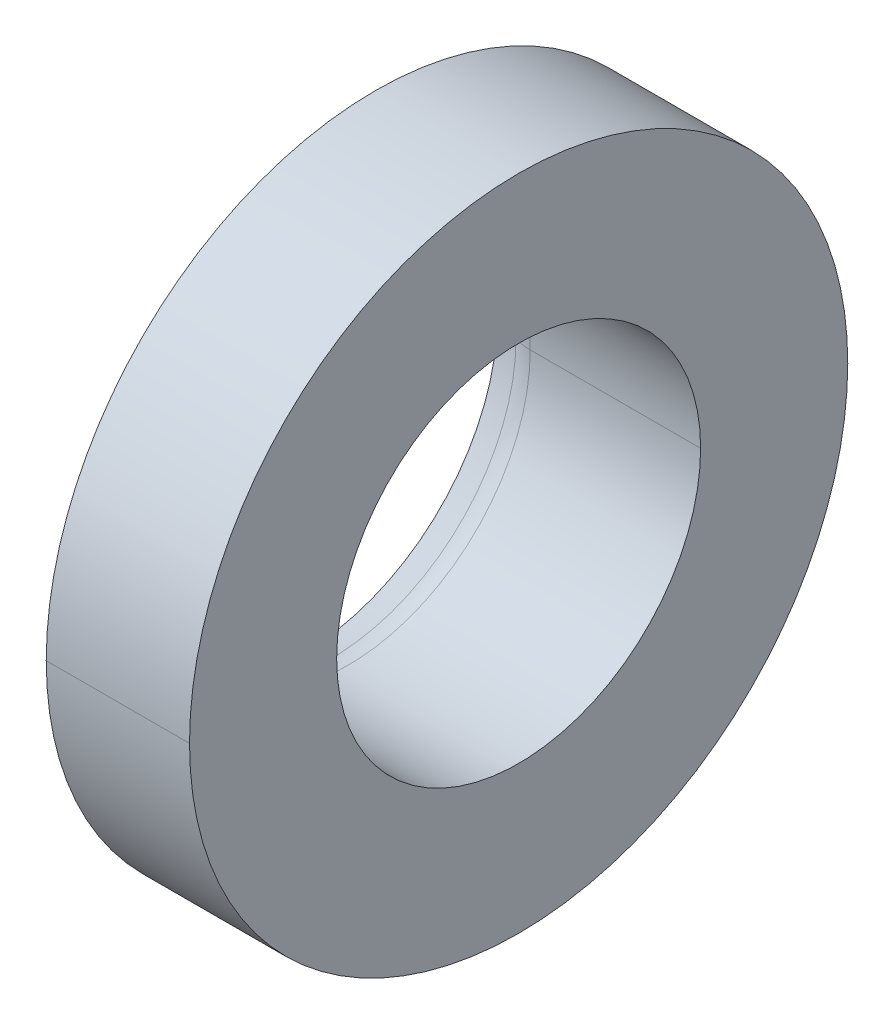
ISO-10303-21;
HEADER;
FILE_DESCRIPTION(('STEP AP214'),'2;1');
FILE_NAME('part.step','',(''),(''),'','','');
FILE_SCHEMA(('AUTOMOTIVE_DESIGN { 1 0 10303 214 1 1 1 1 }'));
ENDSEC;
DATA;
#1=APPLICATION_CONTEXT('core data for automotive mechanical design processes');
#2=APPLICATION_PROTOCOL_DEFINITION('international standard','automotive_design',2000,#1);
#3=PRODUCT_CONTEXT('',#1,'mechanical');
#4=PRODUCT('Part','Part','',(#3));
#5=PRODUCT_RELATED_PRODUCT_CATEGORY('part','',(#4));
#6=PRODUCT_DEFINITION_FORMATION('','',#4);
#7=PRODUCT_DEFINITION_CONTEXT('part definition',#1,'design');
#8=PRODUCT_DEFINITION('design','',#6,#7);
#9=PRODUCT_DEFINITION_SHAPE('','',#8);
#10=(LENGTH_UNIT() NAMED_UNIT(*) SI_UNIT(.MILLI.,.METRE.));
#11=(NAMED_UNIT(*) PLANE_ANGLE_UNIT() SI_UNIT($,.RADIAN.));
#12=(NAMED_UNIT(*) SI_UNIT($,.STERADIAN.) SOLID_ANGLE_UNIT());
#13=UNCERTAINTY_MEASURE_WITH_UNIT(LENGTH_MEASURE(1.E-05),#10,'distance_accuracy_value','');
#14=(GEOMETRIC_REPRESENTATION_CONTEXT(3) GLOBAL_UNCERTAINTY_ASSIGNED_CONTEXT((#13)) GLOBAL_UNIT_ASSIGNED_CONTEXT((#10,
#11,#12)) REPRESENTATION_CONTEXT('',''));
#15=CARTESIAN_POINT('',(0.,0.,0.));
#16=DIRECTION('',(0.,0.,1.));
#17=DIRECTION('',(1.,0.,0.));
#18=AXIS2_PLACEMENT_3D('',#15,#16,#17);
#19=CARTESIAN_POINT('',(-9.97848309128813,0.,0.));
#20=DIRECTION('',(-1.,0.,0.));
#21=DIRECTION('',(0.,0.,1.));
#22=AXIS2_PLACEMENT_3D('',#19,#20,#21);
#23=CONICAL_SURFACE('',#22,2.85490027107471,0.34906585039725);
#24=DIRECTION('',(-0.939692620786461,0.,-0.34202014332415));
#25=VECTOR('',#24,1.);
#26=CARTESIAN_POINT('',(-9.97848309128813,0.,-2.85490027107471));
#27=LINE('',#26,#25);
#28=CARTESIAN_POINT('',(-9.60260604299789,0.,-2.7180922137643));
#29=VERTEX_POINT('',#28);
#30=CARTESIAN_POINT('',(-9.97848309128813,0.,-2.85490027107471));
#31=VERTEX_POINT('',#30);
#32=EDGE_CURVE('E56',#29,#31,#27,.T.);
#33=ORIENTED_EDGE('',*,*,#32,.F.);
#34=CARTESIAN_POINT('',(-9.60260604299789,0.,0.));
#35=DIRECTION('',(-1.,0.,0.));
#36=DIRECTION('',(0.,0.,1.));
#37=AXIS2_PLACEMENT_3D('',#34,#35,#36);
#38=CIRCLE('',#37,2.7180922137643);
#39=CARTESIAN_POINT('',(-9.60260604299789,0.,2.7180922137643));
#40=VERTEX_POINT('',#39);
#41=EDGE_CURVE('E199',#29,#40,#38,.T.);
#42=ORIENTED_EDGE('',*,*,#41,.T.);
#43=DIRECTION('',(-0.939692620786461,0.,0.34202014332415));
#44=VECTOR('',#43,1.);
#45=CARTESIAN_POINT('',(-9.97848309128813,0.,2.85490027107471));
#46=LINE('',#45,#44);
#47=CARTESIAN_POINT('',(-9.97848309128813,0.,2.85490027107471));
#48=VERTEX_POINT('',#47);
#49=EDGE_CURVE('E213',#40,#48,#46,.T.);
#50=ORIENTED_EDGE('',*,*,#49,.T.);
#51=CARTESIAN_POINT('',(-9.97848309128813,0.,0.));
#52=DIRECTION('',(-1.,0.,0.));
#53=DIRECTION('',(0.,0.,1.));
#54=AXIS2_PLACEMENT_3D('',#51,#52,#53);
#55=CIRCLE('',#54,2.85490027107471);
#56=EDGE_CURVE('E11',#31,#48,#55,.T.);
#57=ORIENTED_EDGE('',*,*,#56,.F.);
#58=EDGE_LOOP('',(#33,#42,#50,#57));
#59=FACE_BOUND('',#58,.T.);
#60=ADVANCED_FACE('F17',(#59),#23,.T.);
#61=CARTESIAN_POINT('',(-9.60260604299789,0.,-2.7180922137643));
#62=CARTESIAN_POINT('',(-9.60260604299789,5.43618442752859,-2.7180922137643));
#63=CARTESIAN_POINT('',(-9.60260604299789,5.43618442752859,2.71809221376429));
#64=CARTESIAN_POINT('',(-9.60260604299789,0.,2.7180922137643));
#65=CARTESIAN_POINT('',(-9.56963694430432,0.,-2.70609244318923));
#66=CARTESIAN_POINT('',(-9.56963694430431,5.41218488637845,-2.70609244318923));
#67=CARTESIAN_POINT('',(-9.56963694430431,5.41218488637845,2.70609244318922));
#68=CARTESIAN_POINT('',(-9.56963694430432,0.,2.70609244318923));
#69=CARTESIAN_POINT('',(-9.53508498200828,0.,-2.7));
#70=CARTESIAN_POINT('',(-9.53508498200828,5.4,-2.7));
#71=CARTESIAN_POINT('',(-9.53508498200828,5.4,2.7));
#72=CARTESIAN_POINT('',(-9.53508498200828,0.,2.7));
#73=CARTESIAN_POINT('',(-9.5,0.,-2.7));
#74=CARTESIAN_POINT('',(-9.5,5.4,-2.7));
#75=CARTESIAN_POINT('',(-9.5,5.4,2.7));
#76=CARTESIAN_POINT('',(-9.5,0.,2.7));
#77=(BOUNDED_SURFACE() B_SPLINE_SURFACE(3,3,((#61,#62,#63,#64),(#65,#66,#67,#68),(#69,#70,#71,
#72),(#73,#74,#75,#76)),.UNSPECIFIED.,.F.,.F.,.F.) B_SPLINE_SURFACE_WITH_KNOTS((4,4),(4,4),(0.,
1.),(0.,1.),.UNSPECIFIED.) GEOMETRIC_REPRESENTATION_ITEM() RATIONAL_B_SPLINE_SURFACE(((1.,
0.333333333333334,0.333333333333334,1.),(0.989871835341432,0.329957278447145,0.329957278447145,
0.989871835341432),(0.989871835341432,0.329957278447145,0.329957278447145,0.989871835341432),
(1.,0.333333333333334,0.333333333333334,1.))) REPRESENTATION_ITEM('') SURFACE());
#78=CARTESIAN_POINT('',(-9.5,0.,-3.));
#79=DIRECTION('',(0.,1.,0.));
#80=DIRECTION('',(0.,0.,-1.));
#81=AXIS2_PLACEMENT_3D('',#78,#79,#80);
#82=CIRCLE('',#81,0.3);
#83=CARTESIAN_POINT('',(-9.5,0.,-2.7));
#84=VERTEX_POINT('',#83);
#85=EDGE_CURVE('E194',#29,#84,#82,.T.);
#86=CARTESIAN_POINT('',(-9.60260604299789,0.,0.));
#87=DIRECTION('',(-1.,0.,0.));
#88=DIRECTION('',(0.,0.,1.));
#89=AXIS2_PLACEMENT_3D('',#86,#87,#88);
#90=CIRCLE('',#89,2.7180922137643);
#91=EDGE_CURVE('E205',#40,#29,#90,.T.);
#92=CARTESIAN_POINT('',(-9.5,0.,3.));
#93=DIRECTION('',(0.,-1.,0.));
#94=DIRECTION('',(0.,0.,1.));
#95=AXIS2_PLACEMENT_3D('',#92,#93,#94);
#96=CIRCLE('',#95,0.3);
#97=CARTESIAN_POINT('',(-9.5,0.,2.7));
#98=VERTEX_POINT('',#97);
#99=EDGE_CURVE('E216',#40,#98,#96,.T.);
#100=CARTESIAN_POINT('',(-9.5,0.,0.));
#101=DIRECTION('',(1.,0.,0.));
#102=DIRECTION('',(0.,0.,-1.));
#103=AXIS2_PLACEMENT_3D('',#100,#101,#102);
#104=CIRCLE('',#103,2.7);
#105=EDGE_CURVE('E171',#84,#98,#104,.T.);
#106=ORIENTED_EDGE('',*,*,#85,.F.);
#107=ORIENTED_EDGE('',*,*,#91,.F.);
#108=ORIENTED_EDGE('',*,*,#99,.T.);
#109=ORIENTED_EDGE('',*,*,#105,.F.);
#110=EDGE_LOOP('',(#106,#107,#108,#109));
#111=FACE_BOUND('',#110,.T.);
#112=ADVANCED_FACE('F307',(#111),#77,.F.);
#113=CARTESIAN_POINT('',(-9.97848309137339,0.,0.));
#114=DIRECTION('',(1.,0.,0.));
#115=DIRECTION('',(0.,0.,-1.));
#116=AXIS2_PLACEMENT_3D('',#113,#114,#115);
#117=CONICAL_SURFACE('',#116,2.85490027090418,1.22173047640634);
#118=DIRECTION('',(0.342020143315978,0.,0.939692620789436));
#119=VECTOR('',#118,1.);
#120=CARTESIAN_POINT('',(-9.97848309137339,0.,2.85490027090418));
#121=LINE('',#120,#119);
#122=CARTESIAN_POINT('',(-10.0981901414912,0.,2.52600785381673));
#123=VERTEX_POINT('',#122);
#124=EDGE_CURVE('E183',#123,#48,#121,.T.);
#125=ORIENTED_EDGE('',*,*,#124,.F.);
#126=CARTESIAN_POINT('',(-10.0981901414912,0.,0.));
#127=DIRECTION('',(1.,0.,0.));
#128=DIRECTION('',(0.,0.,-1.));
#129=AXIS2_PLACEMENT_3D('',#126,#127,#128);
#130=CIRCLE('',#129,2.52600785381673);
#131=CARTESIAN_POINT('',(-10.0981901414912,0.,-2.52600785381673));
#132=VERTEX_POINT('',#131);
#133=EDGE_CURVE('E175',#123,#132,#130,.T.);
#134=ORIENTED_EDGE('',*,*,#133,.T.);
#135=DIRECTION('',(0.342020143315978,0.,-0.939692620789436));
#136=VECTOR('',#135,1.);
#137=CARTESIAN_POINT('',(-9.97848309137339,0.,-2.85490027090418));
#138=LINE('',#137,#136);
#139=EDGE_CURVE('E182',#132,#31,#138,.T.);
#140=ORIENTED_EDGE('',*,*,#139,.T.);
#141=ORIENTED_EDGE('',*,*,#56,.T.);
#142=EDGE_LOOP('',(#125,#134,#140,#141));
#143=FACE_BOUND('',#142,.T.);
#144=ADVANCED_FACE('F276',(#143),#117,.T.);
#145=CARTESIAN_POINT('',(-10.23809964855,0.,0.));
#146=DIRECTION('',(1.,0.,0.));
#147=DIRECTION('',(0.,0.,-1.));
#148=AXIS2_PLACEMENT_3D('',#145,#146,#147);
#149=CYLINDRICAL_SURFACE('',#148,2.7);
#150=DIRECTION('',(1.,0.,0.));
#151=VECTOR('',#150,1.);
#152=CARTESIAN_POINT('',(-10.23809964855,0.,2.7));
#153=LINE('',#152,#151);
#154=CARTESIAN_POINT('',(-9.15,0.,2.7));
#155=VERTEX_POINT('',#154);
#156=EDGE_CURVE('E167',#98,#155,#153,.T.);
#157=ORIENTED_EDGE('',*,*,#156,.F.);
#158=CARTESIAN_POINT('',(-9.5,0.,0.));
#159=DIRECTION('',(1.,0.,0.));
#160=DIRECTION('',(0.,0.,-1.));
#161=AXIS2_PLACEMENT_3D('',#158,#159,#160);
#162=CIRCLE('',#161,2.7);
#163=EDGE_CURVE('E198',#98,#84,#162,.T.);
#164=ORIENTED_EDGE('',*,*,#163,.T.);
#165=DIRECTION('',(1.,0.,0.));
#166=VECTOR('',#165,1.);
#167=CARTESIAN_POINT('',(-10.23809964855,0.,-2.7));
#168=LINE('',#167,#166);
#169=CARTESIAN_POINT('',(-9.15,0.,-2.7));
#170=VERTEX_POINT('',#169);
#171=EDGE_CURVE('E234',#84,#170,#168,.T.);
#172=ORIENTED_EDGE('',*,*,#171,.T.);
#173=CARTESIAN_POINT('',(-9.15,0.,0.));
#174=DIRECTION('',(-1.,0.,0.));
#175=DIRECTION('',(0.,0.,-1.));
#176=AXIS2_PLACEMENT_3D('',#173,#174,#175);
#177=CIRCLE('',#176,2.7);
#178=EDGE_CURVE('E28',#170,#155,#177,.T.);
#179=ORIENTED_EDGE('',*,*,#178,.T.);
#180=EDGE_LOOP('',(#157,#164,#172,#179));
#181=FACE_BOUND('',#180,.T.);
#182=ADVANCED_FACE('F329',(#181),#149,.T.);
#183=CARTESIAN_POINT('',(-10.0981901414912,0.,0.));
#184=DIRECTION('',(-1.,0.,0.));
#185=DIRECTION('',(0.,0.,1.));
#186=AXIS2_PLACEMENT_3D('',#183,#184,#185);
#187=CONICAL_SURFACE('',#186,2.52600785381673,0.349065850366811);
#188=DIRECTION('',(-0.939692620796872,0.,-0.342020143295547));
#189=VECTOR('',#188,1.);
#190=CARTESIAN_POINT('',(-10.0981901414912,0.,-2.52600785381673));
#191=LINE('',#190,#189);
#192=CARTESIAN_POINT('',(-9.72231309316191,0.,-2.38919979648924));
#193=VERTEX_POINT('',#192);
#194=EDGE_CURVE('E172',#193,#132,#191,.T.);
#195=ORIENTED_EDGE('',*,*,#194,.F.);
#196=CARTESIAN_POINT('',(-9.72231309316191,0.,0.));
#197=DIRECTION('',(-1.,0.,0.));
#198=DIRECTION('',(0.,0.,1.));
#199=AXIS2_PLACEMENT_3D('',#196,#197,#198);
#200=CIRCLE('',#199,2.38919979648924);
#201=CARTESIAN_POINT('',(-9.72231309316191,0.,2.38919979648924));
#202=VERTEX_POINT('',#201);
#203=EDGE_CURVE('E165',#202,#193,#200,.T.);
#204=ORIENTED_EDGE('',*,*,#203,.F.);
#205=DIRECTION('',(-0.939692620796872,0.,0.342020143295547));
#206=VECTOR('',#205,1.);
#207=CARTESIAN_POINT('',(-10.0981901414912,0.,2.52600785381673));
#208=LINE('',#207,#206);
#209=EDGE_CURVE('E227',#202,#123,#208,.T.);
#210=ORIENTED_EDGE('',*,*,#209,.T.);
#211=CARTESIAN_POINT('',(-10.0981901414912,0.,0.));
#212=DIRECTION('',(1.,0.,0.));
#213=DIRECTION('',(0.,0.,-1.));
#214=AXIS2_PLACEMENT_3D('',#211,#212,#213);
#215=CIRCLE('',#214,2.52600785381673);
#216=EDGE_CURVE('E187',#132,#123,#215,.T.);
#217=ORIENTED_EDGE('',*,*,#216,.F.);
#218=EDGE_LOOP('',(#195,#204,#210,#217));
#219=FACE_BOUND('',#218,.T.);
#220=ADVANCED_FACE('F270',(#219),#187,.F.);
#221=CARTESIAN_POINT('',(-9.15,0.,0.));
#222=DIRECTION('',(1.,0.,0.));
#223=DIRECTION('',(0.,1.,0.));
#224=AXIS2_PLACEMENT_3D('',#221,#222,#223);
#225=PLANE('',#224);
#226=ORIENTED_EDGE('',*,*,#178,.F.);
#227=CARTESIAN_POINT('',(-9.15,0.,0.));
#228=DIRECTION('',(-1.,0.,0.));
#229=DIRECTION('',(0.,0.,-1.));
#230=AXIS2_PLACEMENT_3D('',#227,#228,#229);
#231=CIRCLE('',#230,2.7);
#232=EDGE_CURVE('E170',#155,#170,#231,.T.);
#233=ORIENTED_EDGE('',*,*,#232,.F.);
#234=EDGE_LOOP('',(#226,#233));
#235=FACE_BOUND('',#234,.T.);
#236=CARTESIAN_POINT('',(-9.15,0.,0.));
#237=DIRECTION('',(1.,0.,0.));
#238=DIRECTION('',(0.,0.,-1.));
#239=AXIS2_PLACEMENT_3D('',#236,#237,#238);
#240=CIRCLE('',#239,4.25);
#241=CARTESIAN_POINT('',(-9.15,0.,-4.25));
#242=VERTEX_POINT('',#241);
#243=CARTESIAN_POINT('',(-9.15,0.,4.25));
#244=VERTEX_POINT('',#243);
#245=EDGE_CURVE('E151',#242,#244,#240,.T.);
#246=ORIENTED_EDGE('',*,*,#245,.F.);
#247=CARTESIAN_POINT('',(-9.15,0.,0.));
#248=DIRECTION('',(1.,0.,0.));
#249=DIRECTION('',(0.,0.,-1.));
#250=AXIS2_PLACEMENT_3D('',#247,#248,#249);
#251=CIRCLE('',#250,4.25);
#252=EDGE_CURVE('E128',#244,#242,#251,.T.);
#253=ORIENTED_EDGE('',*,*,#252,.F.);
#254=EDGE_LOOP('',(#246,#253));
#255=FACE_BOUND('',#254,.T.);
#256=ADVANCED_FACE('F336',(#235,#255),#225,.F.);
#257=CARTESIAN_POINT('',(-9.72231309316191,0.,2.38919979648924));
#258=CARTESIAN_POINT('',(-9.7223130931619,-4.77839959297848,2.38919979648924));
#259=CARTESIAN_POINT('',(-9.7223130931619,-4.77839959297848,-2.38919979648924));
#260=CARTESIAN_POINT('',(-9.72231309316191,0.,-2.38919979648924));
#261=CARTESIAN_POINT('',(-9.65088004599256,0.,2.36320029357663));
#262=CARTESIAN_POINT('',(-9.65088004599254,-4.72640058715326,2.36320029357663));
#263=CARTESIAN_POINT('',(-9.65088004599254,-4.72640058715326,-2.36320029357663));
#264=CARTESIAN_POINT('',(-9.65088004599256,0.,-2.36320029357663));
#265=CARTESIAN_POINT('',(-9.57601746101787,0.,2.35));
#266=CARTESIAN_POINT('',(-9.57601746101786,-4.69999999999999,2.35));
#267=CARTESIAN_POINT('',(-9.57601746101786,-4.69999999999999,-2.35));
#268=CARTESIAN_POINT('',(-9.57601746101787,0.,-2.35));
#269=CARTESIAN_POINT('',(-9.5,0.,2.35));
#270=CARTESIAN_POINT('',(-9.5,-4.69999999999999,2.35));
#271=CARTESIAN_POINT('',(-9.5,-4.69999999999999,-2.35));
#272=CARTESIAN_POINT('',(-9.5,0.,-2.35));
#273=(BOUNDED_SURFACE() B_SPLINE_SURFACE(3,3,((#257,#258,#259,#260),(#261,#262,#263,#264),(#265,
#266,#267,#268),(#269,#270,#271,#272)),.UNSPECIFIED.,.F.,.F.,
.F.) B_SPLINE_SURFACE_WITH_KNOTS((4,4),(4,4),(0.,1.),(0.,1.),
.UNSPECIFIED.) GEOMETRIC_REPRESENTATION_ITEM() RATIONAL_B_SPLINE_SURFACE(((1.,0.333333333333334,
0.333333333333334,1.),(0.98987183534145,0.329957278447151,0.329957278447151,0.98987183534145),
(0.98987183534145,0.329957278447151,0.329957278447151,0.98987183534145),(1.,0.333333333333334,
0.333333333333334,1.))) REPRESENTATION_ITEM('') SURFACE());
#274=CARTESIAN_POINT('',(-9.5,0.,-3.));
#275=DIRECTION('',(0.,1.,0.));
#276=DIRECTION('',(0.,0.,-1.));
#277=AXIS2_PLACEMENT_3D('',#274,#275,#276);
#278=CIRCLE('',#277,0.65);
#279=CARTESIAN_POINT('',(-9.5,0.,-2.35));
#280=VERTEX_POINT('',#279);
#281=EDGE_CURVE('E208',#193,#280,#278,.T.);
#282=CARTESIAN_POINT('',(-9.72231309316191,0.,0.));
#283=DIRECTION('',(-1.,0.,0.));
#284=DIRECTION('',(0.,0.,1.));
#285=AXIS2_PLACEMENT_3D('',#282,#283,#284);
#286=CIRCLE('',#285,2.38919979648924);
#287=EDGE_CURVE('E176',#193,#202,#286,.T.);
#288=CARTESIAN_POINT('',(-9.5,0.,3.));
#289=DIRECTION('',(0.,-1.,0.));
#290=DIRECTION('',(0.,0.,1.));
#291=AXIS2_PLACEMENT_3D('',#288,#289,#290);
#292=CIRCLE('',#291,0.65);
#293=CARTESIAN_POINT('',(-9.5,0.,2.35));
#294=VERTEX_POINT('',#293);
#295=EDGE_CURVE('E286',#202,#294,#292,.T.);
#296=CARTESIAN_POINT('',(-9.5,0.,0.));
#297=DIRECTION('',(1.,0.,0.));
#298=DIRECTION('',(0.,0.,-1.));
#299=AXIS2_PLACEMENT_3D('',#296,#297,#298);
#300=CIRCLE('',#299,2.35);
#301=EDGE_CURVE('E161',#294,#280,#300,.T.);
#302=ORIENTED_EDGE('',*,*,#281,.F.);
#303=ORIENTED_EDGE('',*,*,#287,.T.);
#304=ORIENTED_EDGE('',*,*,#295,.T.);
#305=ORIENTED_EDGE('',*,*,#301,.T.);
#306=EDGE_LOOP('',(#302,#303,#304,#305));
#307=FACE_BOUND('',#306,.T.);
#308=ADVANCED_FACE('F330',(#307),#273,.T.);
#309=CARTESIAN_POINT('',(-10.23809964855,0.,0.));
#310=DIRECTION('',(1.,0.,0.));
#311=DIRECTION('',(0.,0.,-1.));
#312=AXIS2_PLACEMENT_3D('',#309,#310,#311);
#313=CYLINDRICAL_SURFACE('',#312,4.25);
#314=DIRECTION('',(1.,0.,0.));
#315=VECTOR('',#314,1.);
#316=CARTESIAN_POINT('',(-10.23809964855,0.,4.25));
#317=LINE('',#316,#315);
#318=CARTESIAN_POINT('',(-7.3,0.,4.25));
#319=VERTEX_POINT('',#318);
#320=EDGE_CURVE('E193',#244,#319,#317,.T.);
#321=ORIENTED_EDGE('',*,*,#320,.F.);
#322=ORIENTED_EDGE('',*,*,#252,.T.);
#323=DIRECTION('',(1.,0.,0.));
#324=VECTOR('',#323,1.);
#325=CARTESIAN_POINT('',(-10.23809964855,0.,-4.25));
#326=LINE('',#325,#324);
#327=CARTESIAN_POINT('',(-7.3,0.,-4.25));
#328=VERTEX_POINT('',#327);
#329=EDGE_CURVE('E192',#242,#328,#326,.T.);
#330=ORIENTED_EDGE('',*,*,#329,.T.);
#331=CARTESIAN_POINT('',(-7.3,0.,0.));
#332=DIRECTION('',(1.,0.,0.));
#333=DIRECTION('',(0.,0.,-1.));
#334=AXIS2_PLACEMENT_3D('',#331,#332,#333);
#335=CIRCLE('',#334,4.25);
#336=EDGE_CURVE('E142',#319,#328,#335,.T.);
#337=ORIENTED_EDGE('',*,*,#336,.F.);
#338=EDGE_LOOP('',(#321,#322,#330,#337));
#339=FACE_BOUND('',#338,.T.);
#340=ADVANCED_FACE('F335',(#339),#313,.T.);
#341=CARTESIAN_POINT('',(-10.23809964855,0.,0.));
#342=DIRECTION('',(1.,0.,0.));
#343=DIRECTION('',(0.,0.,-1.));
#344=AXIS2_PLACEMENT_3D('',#341,#342,#343);
#345=CYLINDRICAL_SURFACE('',#344,2.35);
#346=DIRECTION('',(1.,0.,0.));
#347=VECTOR('',#346,1.);
#348=CARTESIAN_POINT('',(-10.23809964855,0.,2.35));
#349=LINE('',#348,#347);
#350=CARTESIAN_POINT('',(-7.3,0.,2.35));
#351=VERTEX_POINT('',#350);
#352=EDGE_CURVE('E71',#294,#351,#349,.T.);
#353=ORIENTED_EDGE('',*,*,#352,.F.);
#354=CARTESIAN_POINT('',(-9.5,0.,0.));
#355=DIRECTION('',(1.,0.,0.));
#356=DIRECTION('',(0.,0.,-1.));
#357=AXIS2_PLACEMENT_3D('',#354,#355,#356);
#358=CIRCLE('',#357,2.35);
#359=EDGE_CURVE('E146',#280,#294,#358,.T.);
#360=ORIENTED_EDGE('',*,*,#359,.F.);
#361=DIRECTION('',(1.,0.,0.));
#362=VECTOR('',#361,1.);
#363=CARTESIAN_POINT('',(-10.23809964855,0.,-2.35));
#364=LINE('',#363,#362);
#365=CARTESIAN_POINT('',(-7.3,0.,-2.35));
#366=VERTEX_POINT('',#365);
#367=EDGE_CURVE('E143',#280,#366,#364,.T.);
#368=ORIENTED_EDGE('',*,*,#367,.T.);
#369=CARTESIAN_POINT('',(-7.3,0.,0.));
#370=DIRECTION('',(-1.,0.,0.));
#371=DIRECTION('',(0.,0.,-1.));
#372=AXIS2_PLACEMENT_3D('',#369,#370,#371);
#373=CIRCLE('',#372,2.35);
#374=EDGE_CURVE('E21',#351,#366,#373,.T.);
#375=ORIENTED_EDGE('',*,*,#374,.F.);
#376=EDGE_LOOP('',(#353,#360,#368,#375));
#377=FACE_BOUND('',#376,.T.);
#378=ADVANCED_FACE('F144',(#377),#345,.F.);
#379=CARTESIAN_POINT('',(-7.3,0.,0.));
#380=DIRECTION('',(1.,0.,0.));
#381=DIRECTION('',(0.,1.,0.));
#382=AXIS2_PLACEMENT_3D('',#379,#380,#381);
#383=PLANE('',#382);
#384=CARTESIAN_POINT('',(-7.3,0.,0.));
#385=DIRECTION('',(-1.,0.,0.));
#386=DIRECTION('',(0.,0.,-1.));
#387=AXIS2_PLACEMENT_3D('',#384,#385,#386);
#388=CIRCLE('',#387,2.35);
#389=EDGE_CURVE('E140',#366,#351,#388,.T.);
#390=ORIENTED_EDGE('',*,*,#389,.T.);
#391=ORIENTED_EDGE('',*,*,#374,.T.);
#392=EDGE_LOOP('',(#390,#391));
#393=FACE_BOUND('',#392,.T.);
#394=CARTESIAN_POINT('',(-7.3,0.,0.));
#395=DIRECTION('',(1.,0.,0.));
#396=DIRECTION('',(0.,0.,-1.));
#397=AXIS2_PLACEMENT_3D('',#394,#395,#396);
#398=CIRCLE('',#397,4.25);
#399=EDGE_CURVE('E188',#328,#319,#398,.T.);
#400=ORIENTED_EDGE('',*,*,#399,.T.);
#401=ORIENTED_EDGE('',*,*,#336,.T.);
#402=EDGE_LOOP('',(#400,#401));
#403=FACE_BOUND('',#402,.T.);
#404=ADVANCED_FACE('F137',(#393,#403),#383,.T.);
#405=CARTESIAN_POINT('',(-9.97848309128813,0.,0.));
#406=DIRECTION('',(-1.,0.,0.));
#407=DIRECTION('',(0.,0.,1.));
#408=AXIS2_PLACEMENT_3D('',#405,#406,#407);
#409=CONICAL_SURFACE('',#408,2.85490027107471,0.34906585039725);
#410=ORIENTED_EDGE('',*,*,#91,.T.);
#411=ORIENTED_EDGE('',*,*,#32,.T.);
#412=CARTESIAN_POINT('',(-9.97848309128813,0.,0.));
#413=DIRECTION('',(-1.,0.,0.));
#414=DIRECTION('',(0.,0.,1.));
#415=AXIS2_PLACEMENT_3D('',#412,#413,#414);
#416=CIRCLE('',#415,2.85490027107471);
#417=EDGE_CURVE('E178',#48,#31,#416,.T.);
#418=ORIENTED_EDGE('',*,*,#417,.F.);
#419=ORIENTED_EDGE('',*,*,#49,.F.);
#420=EDGE_LOOP('',(#410,#411,#418,#419));
#421=FACE_BOUND('',#420,.T.);
#422=ADVANCED_FACE('F309',(#421),#409,.T.);
#423=CARTESIAN_POINT('',(-9.97848309137339,0.,0.));
#424=DIRECTION('',(1.,0.,0.));
#425=DIRECTION('',(0.,0.,-1.));
#426=AXIS2_PLACEMENT_3D('',#423,#424,#425);
#427=CONICAL_SURFACE('',#426,2.85490027090418,1.22173047640634);
#428=ORIENTED_EDGE('',*,*,#216,.T.);
#429=ORIENTED_EDGE('',*,*,#124,.T.);
#430=ORIENTED_EDGE('',*,*,#417,.T.);
#431=ORIENTED_EDGE('',*,*,#139,.F.);
#432=EDGE_LOOP('',(#428,#429,#430,#431));
#433=FACE_BOUND('',#432,.T.);
#434=ADVANCED_FACE('F278',(#433),#427,.T.);
#435=CARTESIAN_POINT('',(-10.23809964855,0.,0.));
#436=DIRECTION('',(1.,0.,0.));
#437=DIRECTION('',(0.,0.,-1.));
#438=AXIS2_PLACEMENT_3D('',#435,#436,#437);
#439=CYLINDRICAL_SURFACE('',#438,2.7);
#440=ORIENTED_EDGE('',*,*,#105,.T.);
#441=ORIENTED_EDGE('',*,*,#156,.T.);
#442=ORIENTED_EDGE('',*,*,#232,.T.);
#443=ORIENTED_EDGE('',*,*,#171,.F.);
#444=EDGE_LOOP('',(#440,#441,#442,#443));
#445=FACE_BOUND('',#444,.T.);
#446=ADVANCED_FACE('F317',(#445),#439,.T.);
#447=CARTESIAN_POINT('',(-10.0981901414912,0.,0.));
#448=DIRECTION('',(-1.,0.,0.));
#449=DIRECTION('',(0.,0.,1.));
#450=AXIS2_PLACEMENT_3D('',#447,#448,#449);
#451=CONICAL_SURFACE('',#450,2.52600785381673,0.349065850366811);
#452=ORIENTED_EDGE('',*,*,#287,.F.);
#453=ORIENTED_EDGE('',*,*,#194,.T.);
#454=ORIENTED_EDGE('',*,*,#133,.F.);
#455=ORIENTED_EDGE('',*,*,#209,.F.);
#456=EDGE_LOOP('',(#452,#453,#454,#455));
#457=FACE_BOUND('',#456,.T.);
#458=ADVANCED_FACE('F19',(#457),#451,.F.);
#459=CARTESIAN_POINT('',(-10.23809964855,0.,0.));
#460=DIRECTION('',(1.,0.,0.));
#461=DIRECTION('',(0.,0.,-1.));
#462=AXIS2_PLACEMENT_3D('',#459,#460,#461);
#463=CYLINDRICAL_SURFACE('',#462,4.25);
#464=ORIENTED_EDGE('',*,*,#245,.T.);
#465=ORIENTED_EDGE('',*,*,#320,.T.);
#466=ORIENTED_EDGE('',*,*,#399,.F.);
#467=ORIENTED_EDGE('',*,*,#329,.F.);
#468=EDGE_LOOP('',(#464,#465,#466,#467));
#469=FACE_BOUND('',#468,.T.);
#470=ADVANCED_FACE('F345',(#469),#463,.T.);
#471=CARTESIAN_POINT('',(-10.23809964855,0.,0.));
#472=DIRECTION('',(1.,0.,0.));
#473=DIRECTION('',(0.,0.,-1.));
#474=AXIS2_PLACEMENT_3D('',#471,#472,#473);
#475=CYLINDRICAL_SURFACE('',#474,2.35);
#476=ORIENTED_EDGE('',*,*,#301,.F.);
#477=ORIENTED_EDGE('',*,*,#352,.T.);
#478=ORIENTED_EDGE('',*,*,#389,.F.);
#479=ORIENTED_EDGE('',*,*,#367,.F.);
#480=EDGE_LOOP('',(#476,#477,#478,#479));
#481=FACE_BOUND('',#480,.T.);
#482=ADVANCED_FACE('F153',(#481),#475,.F.);
#483=CARTESIAN_POINT('',(-9.60260604299789,0.,2.7180922137643));
#484=CARTESIAN_POINT('',(-9.60260604299789,-5.43618442752859,2.7180922137643));
#485=CARTESIAN_POINT('',(-9.60260604299789,-5.43618442752859,-2.71809221376429));
#486=CARTESIAN_POINT('',(-9.60260604299789,0.,-2.7180922137643));
#487=CARTESIAN_POINT('',(-9.56963694430432,0.,2.70609244318923));
#488=CARTESIAN_POINT('',(-9.56963694430431,-5.41218488637845,2.70609244318923));
#489=CARTESIAN_POINT('',(-9.56963694430431,-5.41218488637845,-2.70609244318922));
#490=CARTESIAN_POINT('',(-9.56963694430432,0.,-2.70609244318923));
#491=CARTESIAN_POINT('',(-9.53508498200828,0.,2.7));
#492=CARTESIAN_POINT('',(-9.53508498200828,-5.4,2.7));
#493=CARTESIAN_POINT('',(-9.53508498200828,-5.4,-2.7));
#494=CARTESIAN_POINT('',(-9.53508498200828,0.,-2.7));
#495=CARTESIAN_POINT('',(-9.5,0.,2.7));
#496=CARTESIAN_POINT('',(-9.5,-5.4,2.7));
#497=CARTESIAN_POINT('',(-9.5,-5.4,-2.7));
#498=CARTESIAN_POINT('',(-9.5,0.,-2.7));
#499=(BOUNDED_SURFACE() B_SPLINE_SURFACE(3,3,((#483,#484,#485,#486),(#487,#488,#489,#490),(#491,
#492,#493,#494),(#495,#496,#497,#498)),.UNSPECIFIED.,.F.,.F.,
.F.) B_SPLINE_SURFACE_WITH_KNOTS((4,4),(4,4),(0.,1.),(0.,1.),
.UNSPECIFIED.) GEOMETRIC_REPRESENTATION_ITEM() RATIONAL_B_SPLINE_SURFACE(((1.,0.333333333333334,
0.333333333333334,1.),(0.989871835341432,0.329957278447145,0.329957278447145,0.989871835341432),
(0.989871835341432,0.329957278447145,0.329957278447145,0.989871835341432),(1.,0.333333333333334,
0.333333333333334,1.))) REPRESENTATION_ITEM('') SURFACE());
#500=ORIENTED_EDGE('',*,*,#41,.F.);
#501=ORIENTED_EDGE('',*,*,#85,.T.);
#502=ORIENTED_EDGE('',*,*,#163,.F.);
#503=ORIENTED_EDGE('',*,*,#99,.F.);
#504=EDGE_LOOP('',(#500,#501,#502,#503));
#505=FACE_BOUND('',#504,.T.);
#506=ADVANCED_FACE('F301',(#505),#499,.F.);
#507=CARTESIAN_POINT('',(-9.72231309316191,0.,-2.38919979648924));
#508=CARTESIAN_POINT('',(-9.7223130931619,4.77839959297848,-2.38919979648924));
#509=CARTESIAN_POINT('',(-9.7223130931619,4.77839959297848,2.38919979648924));
#510=CARTESIAN_POINT('',(-9.72231309316191,0.,2.38919979648924));
#511=CARTESIAN_POINT('',(-9.65088004599256,0.,-2.36320029357663));
#512=CARTESIAN_POINT('',(-9.65088004599254,4.72640058715326,-2.36320029357663));
#513=CARTESIAN_POINT('',(-9.65088004599254,4.72640058715326,2.36320029357663));
#514=CARTESIAN_POINT('',(-9.65088004599256,0.,2.36320029357663));
#515=CARTESIAN_POINT('',(-9.57601746101787,0.,-2.35));
#516=CARTESIAN_POINT('',(-9.57601746101786,4.69999999999999,-2.35));
#517=CARTESIAN_POINT('',(-9.57601746101786,4.69999999999999,2.35));
#518=CARTESIAN_POINT('',(-9.57601746101787,0.,2.35));
#519=CARTESIAN_POINT('',(-9.5,0.,-2.35));
#520=CARTESIAN_POINT('',(-9.5,4.69999999999999,-2.35));
#521=CARTESIAN_POINT('',(-9.5,4.69999999999999,2.35));
#522=CARTESIAN_POINT('',(-9.5,0.,2.35));
#523=(BOUNDED_SURFACE() B_SPLINE_SURFACE(3,3,((#507,#508,#509,#510),(#511,#512,#513,#514),(#515,
#516,#517,#518),(#519,#520,#521,#522)),.UNSPECIFIED.,.F.,.F.,
.F.) B_SPLINE_SURFACE_WITH_KNOTS((4,4),(4,4),(0.,1.),(0.,1.),
.UNSPECIFIED.) GEOMETRIC_REPRESENTATION_ITEM() RATIONAL_B_SPLINE_SURFACE(((1.,0.333333333333334,
0.333333333333334,1.),(0.98987183534145,0.329957278447151,0.329957278447151,0.98987183534145),
(0.98987183534145,0.329957278447151,0.329957278447151,0.98987183534145),(1.,0.333333333333334,
0.333333333333334,1.))) REPRESENTATION_ITEM('') SURFACE());
#524=ORIENTED_EDGE('',*,*,#203,.T.);
#525=ORIENTED_EDGE('',*,*,#281,.T.);
#526=ORIENTED_EDGE('',*,*,#359,.T.);
#527=ORIENTED_EDGE('',*,*,#295,.F.);
#528=EDGE_LOOP('',(#524,#525,#526,#527));
#529=FACE_BOUND('',#528,.T.);
#530=ADVANCED_FACE('F352',(#529),#523,.T.);
#531=CLOSED_SHELL('',(#60,#112,#144,#182,#220,#256,#308,#340,#378,#404,#422,#434,#446,#458,#470,
#482,#506,#530));
#532=MANIFOLD_SOLID_BREP('B1',#531);
#533=ADVANCED_BREP_SHAPE_REPRESENTATION('',(#18,#532),#14);
#534=SHAPE_DEFINITION_REPRESENTATION(#9,#533);
ENDSEC;
END-ISO-10303-21;
